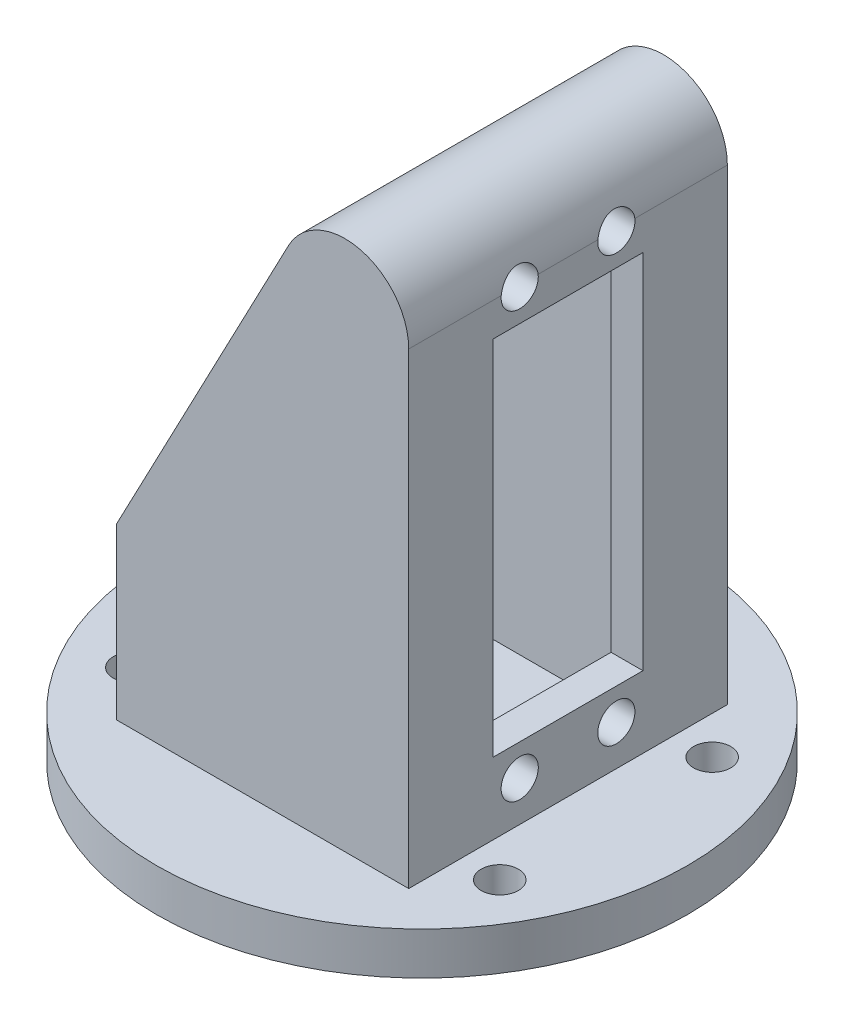
ISO-10303-21;
HEADER;
FILE_DESCRIPTION(('STEP AP214'),'2;1');
FILE_NAME('part.step','',(''),(''),'','','');
FILE_SCHEMA(('AUTOMOTIVE_DESIGN { 1 0 10303 214 1 1 1 1 }'));
ENDSEC;
DATA;
#1=APPLICATION_CONTEXT('core data for automotive mechanical design processes');
#2=APPLICATION_PROTOCOL_DEFINITION('international standard','automotive_design',2000,#1);
#3=PRODUCT_CONTEXT('',#1,'mechanical');
#4=PRODUCT('Part','Part','',(#3));
#5=PRODUCT_RELATED_PRODUCT_CATEGORY('part','',(#4));
#6=PRODUCT_DEFINITION_FORMATION('','',#4);
#7=PRODUCT_DEFINITION_CONTEXT('part definition',#1,'design');
#8=PRODUCT_DEFINITION('design','',#6,#7);
#9=PRODUCT_DEFINITION_SHAPE('','',#8);
#10=(LENGTH_UNIT() NAMED_UNIT(*) SI_UNIT(.MILLI.,.METRE.));
#11=(NAMED_UNIT(*) PLANE_ANGLE_UNIT() SI_UNIT($,.RADIAN.));
#12=(NAMED_UNIT(*) SI_UNIT($,.STERADIAN.) SOLID_ANGLE_UNIT());
#13=UNCERTAINTY_MEASURE_WITH_UNIT(LENGTH_MEASURE(1.E-05),#10,'distance_accuracy_value','');
#14=(GEOMETRIC_REPRESENTATION_CONTEXT(3) GLOBAL_UNCERTAINTY_ASSIGNED_CONTEXT((#13)) GLOBAL_UNIT_ASSIGNED_CONTEXT((#10,
#11,#12)) REPRESENTATION_CONTEXT('',''));
#15=CARTESIAN_POINT('',(0.,0.,0.));
#16=DIRECTION('',(0.,0.,1.));
#17=DIRECTION('',(1.,0.,0.));
#18=AXIS2_PLACEMENT_3D('',#15,#16,#17);
#19=CARTESIAN_POINT('',(10.75,0.,0.));
#20=DIRECTION('',(1.,0.,0.));
#21=DIRECTION('',(0.,0.,-1.));
#22=AXIS2_PLACEMENT_3D('',#19,#20,#21);
#23=PLANE('',#22);
#24=DIRECTION('',(0.,-1.,0.));
#25=VECTOR('',#24,1.);
#26=CARTESIAN_POINT('',(10.75,4.79216492436842,-8.5));
#27=LINE('',#26,#25);
#28=CARTESIAN_POINT('',(10.75,50.7921649243684,-8.5));
#29=VERTEX_POINT('',#28);
#30=CARTESIAN_POINT('',(10.75,4.79216492436842,-8.5));
#31=VERTEX_POINT('',#30);
#32=EDGE_CURVE('E643',#29,#31,#27,.T.);
#33=ORIENTED_EDGE('',*,*,#32,.T.);
#34=DIRECTION('',(0.,0.,1.));
#35=VECTOR('',#34,1.);
#36=CARTESIAN_POINT('',(10.75,4.79216492436842,-8.5));
#37=LINE('',#36,#35);
#38=CARTESIAN_POINT('',(10.75,4.79216492436842,8.5));
#39=VERTEX_POINT('',#38);
#40=EDGE_CURVE('E645',#31,#39,#37,.T.);
#41=ORIENTED_EDGE('',*,*,#40,.T.);
#42=DIRECTION('',(0.,1.,0.));
#43=VECTOR('',#42,1.);
#44=CARTESIAN_POINT('',(10.75,4.79216492436842,8.5));
#45=LINE('',#44,#43);
#46=CARTESIAN_POINT('',(10.75,50.7921649243684,8.5));
#47=VERTEX_POINT('',#46);
#48=EDGE_CURVE('E649',#39,#47,#45,.T.);
#49=ORIENTED_EDGE('',*,*,#48,.T.);
#50=DIRECTION('',(0.,0.,-1.));
#51=VECTOR('',#50,1.);
#52=CARTESIAN_POINT('',(10.75,50.7921649243684,-8.5));
#53=LINE('',#52,#51);
#54=EDGE_CURVE('E652',#47,#29,#53,.T.);
#55=ORIENTED_EDGE('',*,*,#54,.T.);
#56=EDGE_LOOP('',(#33,#41,#49,#55));
#57=FACE_BOUND('',#56,.T.);
#58=CARTESIAN_POINT('',(10.75,47.8021649243684,-4.55));
#59=DIRECTION('',(-1.,0.,0.));
#60=DIRECTION('',(0.,0.,1.));
#61=AXIS2_PLACEMENT_3D('',#58,#59,#60);
#62=CIRCLE('',#61,1.75);
#63=CARTESIAN_POINT('',(10.75,47.8021649243684,-2.8));
#64=VERTEX_POINT('',#63);
#65=EDGE_CURVE('E352',#64,#64,#62,.T.);
#66=ORIENTED_EDGE('',*,*,#65,.F.);
#67=EDGE_LOOP('',(#66));
#68=FACE_BOUND('',#67,.T.);
#69=CARTESIAN_POINT('',(10.75,7.78216492436842,-4.55));
#70=DIRECTION('',(-1.,0.,0.));
#71=DIRECTION('',(0.,0.,-1.));
#72=AXIS2_PLACEMENT_3D('',#69,#70,#71);
#73=CIRCLE('',#72,1.75);
#74=CARTESIAN_POINT('',(10.75,7.78216492436842,-6.3));
#75=VERTEX_POINT('',#74);
#76=EDGE_CURVE('E443',#75,#75,#73,.T.);
#77=ORIENTED_EDGE('',*,*,#76,.F.);
#78=EDGE_LOOP('',(#77));
#79=FACE_BOUND('',#78,.T.);
#80=CARTESIAN_POINT('',(10.75,7.78216492436842,4.55000000000001));
#81=DIRECTION('',(-1.,0.,0.));
#82=DIRECTION('',(0.,0.,1.));
#83=AXIS2_PLACEMENT_3D('',#80,#81,#82);
#84=CIRCLE('',#83,1.75);
#85=CARTESIAN_POINT('',(10.75,7.78216492436842,6.30000000000001));
#86=VERTEX_POINT('',#85);
#87=EDGE_CURVE('E181',#86,#86,#84,.T.);
#88=ORIENTED_EDGE('',*,*,#87,.F.);
#89=EDGE_LOOP('',(#88));
#90=FACE_BOUND('',#89,.T.);
#91=CARTESIAN_POINT('',(10.75,47.8021649243684,4.55));
#92=DIRECTION('',(-1.,0.,0.));
#93=DIRECTION('',(0.,0.,-1.));
#94=AXIS2_PLACEMENT_3D('',#91,#92,#93);
#95=CIRCLE('',#94,1.75);
#96=CARTESIAN_POINT('',(10.75,47.8021649243684,2.8));
#97=VERTEX_POINT('',#96);
#98=EDGE_CURVE('E173',#97,#97,#95,.T.);
#99=ORIENTED_EDGE('',*,*,#98,.F.);
#100=EDGE_LOOP('',(#99));
#101=FACE_BOUND('',#100,.T.);
#102=DIRECTION('',(0.,-1.,0.));
#103=VECTOR('',#102,1.);
#104=CARTESIAN_POINT('',(10.75,10.7421649243684,-7.05));
#105=LINE('',#104,#103);
#106=CARTESIAN_POINT('',(10.75,44.8421649243684,-7.05));
#107=VERTEX_POINT('',#106);
#108=CARTESIAN_POINT('',(10.75,10.7421649243684,-7.05));
#109=VERTEX_POINT('',#108);
#110=EDGE_CURVE('E403',#107,#109,#105,.T.);
#111=ORIENTED_EDGE('',*,*,#110,.F.);
#112=DIRECTION('',(0.,0.,-1.));
#113=VECTOR('',#112,1.);
#114=CARTESIAN_POINT('',(10.75,44.8421649243684,7.05));
#115=LINE('',#114,#113);
#116=CARTESIAN_POINT('',(10.75,44.8421649243684,7.05));
#117=VERTEX_POINT('',#116);
#118=EDGE_CURVE('E411',#117,#107,#115,.T.);
#119=ORIENTED_EDGE('',*,*,#118,.F.);
#120=DIRECTION('',(0.,1.,0.));
#121=VECTOR('',#120,1.);
#122=CARTESIAN_POINT('',(10.75,10.7421649243684,7.05));
#123=LINE('',#122,#121);
#124=CARTESIAN_POINT('',(10.75,10.7421649243684,7.05));
#125=VERTEX_POINT('',#124);
#126=EDGE_CURVE('E409',#125,#117,#123,.T.);
#127=ORIENTED_EDGE('',*,*,#126,.F.);
#128=DIRECTION('',(0.,0.,1.));
#129=VECTOR('',#128,1.);
#130=CARTESIAN_POINT('',(10.75,10.7421649243684,7.05));
#131=LINE('',#130,#129);
#132=EDGE_CURVE('E406',#109,#125,#131,.T.);
#133=ORIENTED_EDGE('',*,*,#132,.F.);
#134=EDGE_LOOP('',(#111,#119,#127,#133));
#135=FACE_BOUND('',#134,.T.);
#136=ADVANCED_FACE('F57',(#57,#68,#79,#90,#101,#135),#23,.F.);
#137=CARTESIAN_POINT('',(-19.0103038057282,9.99484804125848,-25.));
#138=DIRECTION('',(0.885121068855159,-0.465360820728068,0.));
#139=DIRECTION('',(0.465360820728068,0.885121068855159,0.));
#140=AXIS2_PLACEMENT_3D('',#137,#138,#139);
#141=PLANE('',#140);
#142=DIRECTION('',(0.,0.,1.));
#143=VECTOR('',#142,1.);
#144=CARTESIAN_POINT('',(-13.75,20.,-25.));
#145=LINE('',#144,#143);
#146=CARTESIAN_POINT('',(-13.75,20.,-15.));
#147=VERTEX_POINT('',#146);
#148=CARTESIAN_POINT('',(-13.75,20.,-8.5));
#149=VERTEX_POINT('',#148);
#150=EDGE_CURVE('E205',#147,#149,#145,.T.);
#151=ORIENTED_EDGE('',*,*,#150,.T.);
#152=DIRECTION('',(0.465360820728068,0.885121068855159,0.));
#153=VECTOR('',#152,1.);
#154=CARTESIAN_POINT('',(-19.0103038057282,9.99484804125848,-8.5));
#155=LINE('',#154,#153);
#156=CARTESIAN_POINT('',(2.43927358686905,50.7921649243684,-8.5));
#157=VERTEX_POINT('',#156);
#158=EDGE_CURVE('E187',#149,#157,#155,.T.);
#159=ORIENTED_EDGE('',*,*,#158,.T.);
#160=DIRECTION('',(0.,0.,1.));
#161=VECTOR('',#160,1.);
#162=CARTESIAN_POINT('',(2.43927358686906,50.7921649243684,-25.));
#163=LINE('',#162,#161);
#164=CARTESIAN_POINT('',(2.43927358686906,50.7921649243684,-15.));
#165=VERTEX_POINT('',#164);
#166=EDGE_CURVE('E210',#165,#157,#163,.T.);
#167=ORIENTED_EDGE('',*,*,#166,.F.);
#168=DIRECTION('',(0.465360820728068,0.885121068855159,0.));
#169=VECTOR('',#168,1.);
#170=CARTESIAN_POINT('',(6.21004174995811,57.9642047658331,-15.));
#171=LINE('',#170,#169);
#172=EDGE_CURVE('E12',#147,#165,#171,.T.);
#173=ORIENTED_EDGE('',*,*,#172,.F.);
#174=EDGE_LOOP('',(#151,#159,#167,#173));
#175=FACE_BOUND('',#174,.T.);
#176=ADVANCED_FACE('F294',(#175),#141,.F.);
#177=CARTESIAN_POINT('',(13.75,54.,15.));
#178=DIRECTION('',(0.,0.,-1.));
#179=DIRECTION('',(-1.,0.,0.));
#180=AXIS2_PLACEMENT_3D('',#177,#178,#179);
#181=PLANE('',#180);
#182=DIRECTION('',(0.,-1.,0.));
#183=VECTOR('',#182,1.);
#184=CARTESIAN_POINT('',(13.75,54.,15.));
#185=LINE('',#184,#183);
#186=CARTESIAN_POINT('',(13.75,48.,15.));
#187=VERTEX_POINT('',#186);
#188=CARTESIAN_POINT('',(13.75,4.,15.));
#189=VERTEX_POINT('',#188);
#190=EDGE_CURVE('E231',#187,#189,#185,.T.);
#191=ORIENTED_EDGE('',*,*,#190,.F.);
#192=CARTESIAN_POINT('',(7.75,48.,15.));
#193=DIRECTION('',(0.,0.,1.));
#194=DIRECTION('',(1.,0.,0.));
#195=AXIS2_PLACEMENT_3D('',#192,#193,#194);
#196=CIRCLE('',#195,6.);
#197=CARTESIAN_POINT('',(2.43927358686906,50.7921649243684,15.));
#198=VERTEX_POINT('',#197);
#199=EDGE_CURVE('E185',#198,#187,#196,.F.);
#200=ORIENTED_EDGE('',*,*,#199,.F.);
#201=DIRECTION('',(0.465360820728068,0.885121068855159,0.));
#202=VECTOR('',#201,1.);
#203=CARTESIAN_POINT('',(-19.0103038057282,9.99484804125848,15.));
#204=LINE('',#203,#202);
#205=CARTESIAN_POINT('',(-13.75,20.,15.));
#206=VERTEX_POINT('',#205);
#207=EDGE_CURVE('E195',#206,#198,#204,.T.);
#208=ORIENTED_EDGE('',*,*,#207,.F.);
#209=DIRECTION('',(0.,-1.,0.));
#210=VECTOR('',#209,1.);
#211=CARTESIAN_POINT('',(-13.75,54.,15.));
#212=LINE('',#211,#210);
#213=CARTESIAN_POINT('',(-13.75,4.,15.));
#214=VERTEX_POINT('',#213);
#215=EDGE_CURVE('E233',#206,#214,#212,.T.);
#216=ORIENTED_EDGE('',*,*,#215,.T.);
#217=DIRECTION('',(1.,0.,0.));
#218=VECTOR('',#217,1.);
#219=CARTESIAN_POINT('',(13.75,4.,15.));
#220=LINE('',#219,#218);
#221=EDGE_CURVE('E218',#214,#189,#220,.T.);
#222=ORIENTED_EDGE('',*,*,#221,.T.);
#223=EDGE_LOOP('',(#191,#200,#208,#216,#222));
#224=FACE_BOUND('',#223,.T.);
#225=ADVANCED_FACE('F300',(#224),#181,.F.);
#226=CARTESIAN_POINT('',(13.75,54.,-15.));
#227=DIRECTION('',(0.,0.,1.));
#228=DIRECTION('',(1.,0.,0.));
#229=AXIS2_PLACEMENT_3D('',#226,#227,#228);
#230=PLANE('',#229);
#231=CARTESIAN_POINT('',(7.75,48.,-15.));
#232=DIRECTION('',(0.,0.,1.));
#233=DIRECTION('',(1.,0.,0.));
#234=AXIS2_PLACEMENT_3D('',#231,#232,#233);
#235=CIRCLE('',#234,6.);
#236=CARTESIAN_POINT('',(13.75,48.,-15.));
#237=VERTEX_POINT('',#236);
#238=EDGE_CURVE('E208',#165,#237,#235,.F.);
#239=ORIENTED_EDGE('',*,*,#238,.T.);
#240=DIRECTION('',(0.,-1.,0.));
#241=VECTOR('',#240,1.);
#242=CARTESIAN_POINT('',(13.75,54.,-15.));
#243=LINE('',#242,#241);
#244=CARTESIAN_POINT('',(13.75,4.,-15.));
#245=VERTEX_POINT('',#244);
#246=EDGE_CURVE('E229',#237,#245,#243,.T.);
#247=ORIENTED_EDGE('',*,*,#246,.T.);
#248=DIRECTION('',(-1.,0.,0.));
#249=VECTOR('',#248,1.);
#250=CARTESIAN_POINT('',(13.75,4.,-15.));
#251=LINE('',#250,#249);
#252=CARTESIAN_POINT('',(-13.75,4.,-15.));
#253=VERTEX_POINT('',#252);
#254=EDGE_CURVE('E224',#245,#253,#251,.T.);
#255=ORIENTED_EDGE('',*,*,#254,.T.);
#256=DIRECTION('',(0.,-1.,0.));
#257=VECTOR('',#256,1.);
#258=CARTESIAN_POINT('',(-13.75,54.,-15.));
#259=LINE('',#258,#257);
#260=EDGE_CURVE('E227',#147,#253,#259,.T.);
#261=ORIENTED_EDGE('',*,*,#260,.F.);
#262=ORIENTED_EDGE('',*,*,#172,.T.);
#263=EDGE_LOOP('',(#239,#247,#255,#261,#262));
#264=FACE_BOUND('',#263,.T.);
#265=ADVANCED_FACE('F329',(#264),#230,.F.);
#266=CARTESIAN_POINT('',(13.75,54.,15.));
#267=DIRECTION('',(-1.,0.,0.));
#268=DIRECTION('',(0.,0.,1.));
#269=AXIS2_PLACEMENT_3D('',#266,#267,#268);
#270=PLANE('',#269);
#271=DIRECTION('',(0.,0.,1.));
#272=VECTOR('',#271,1.);
#273=CARTESIAN_POINT('',(13.75,44.8421649243684,7.05));
#274=LINE('',#273,#272);
#275=CARTESIAN_POINT('',(13.75,44.8421649243684,-7.05));
#276=VERTEX_POINT('',#275);
#277=CARTESIAN_POINT('',(13.75,44.8421649243684,7.05));
#278=VERTEX_POINT('',#277);
#279=EDGE_CURVE('E397',#276,#278,#274,.T.);
#280=ORIENTED_EDGE('',*,*,#279,.F.);
#281=DIRECTION('',(0.,1.,0.));
#282=VECTOR('',#281,1.);
#283=CARTESIAN_POINT('',(13.75,10.7421649243684,-7.05));
#284=LINE('',#283,#282);
#285=CARTESIAN_POINT('',(13.75,10.7421649243684,-7.05));
#286=VERTEX_POINT('',#285);
#287=EDGE_CURVE('E400',#286,#276,#284,.T.);
#288=ORIENTED_EDGE('',*,*,#287,.F.);
#289=DIRECTION('',(0.,0.,-1.));
#290=VECTOR('',#289,1.);
#291=CARTESIAN_POINT('',(13.75,10.7421649243684,7.05));
#292=LINE('',#291,#290);
#293=CARTESIAN_POINT('',(13.75,10.7421649243684,7.05));
#294=VERTEX_POINT('',#293);
#295=EDGE_CURVE('E417',#294,#286,#292,.T.);
#296=ORIENTED_EDGE('',*,*,#295,.F.);
#297=DIRECTION('',(0.,-1.,0.));
#298=VECTOR('',#297,1.);
#299=CARTESIAN_POINT('',(13.75,10.7421649243684,7.05));
#300=LINE('',#299,#298);
#301=EDGE_CURVE('E72',#278,#294,#300,.T.);
#302=ORIENTED_EDGE('',*,*,#301,.F.);
#303=EDGE_LOOP('',(#280,#288,#296,#302));
#304=FACE_BOUND('',#303,.T.);
#305=CARTESIAN_POINT('',(13.75,7.78216492436842,4.55000000000001));
#306=DIRECTION('',(-1.,0.,0.));
#307=DIRECTION('',(0.,0.,1.));
#308=AXIS2_PLACEMENT_3D('',#305,#306,#307);
#309=CIRCLE('',#308,1.75);
#310=CARTESIAN_POINT('',(13.75,7.78216492436842,6.30000000000001));
#311=VERTEX_POINT('',#310);
#312=EDGE_CURVE('E439',#311,#311,#309,.F.);
#313=ORIENTED_EDGE('',*,*,#312,.F.);
#314=EDGE_LOOP('',(#313));
#315=FACE_BOUND('',#314,.T.);
#316=CARTESIAN_POINT('',(13.75,7.78216492436842,-4.55));
#317=DIRECTION('',(-1.,0.,0.));
#318=DIRECTION('',(0.,0.,1.));
#319=AXIS2_PLACEMENT_3D('',#316,#317,#318);
#320=CIRCLE('',#319,1.75);
#321=CARTESIAN_POINT('',(13.75,7.78216492436842,-2.79999999999999));
#322=VERTEX_POINT('',#321);
#323=EDGE_CURVE('E357',#322,#322,#320,.F.);
#324=ORIENTED_EDGE('',*,*,#323,.F.);
#325=EDGE_LOOP('',(#324));
#326=FACE_BOUND('',#325,.T.);
#327=DIRECTION('',(0.,0.,1.));
#328=VECTOR('',#327,1.);
#329=CARTESIAN_POINT('',(13.75,48.,-25.));
#330=LINE('',#329,#328);
#331=CARTESIAN_POINT('',(13.75,48.,-2.81121844878379));
#332=VERTEX_POINT('',#331);
#333=CARTESIAN_POINT('',(13.75,48.,2.8112184487838));
#334=VERTEX_POINT('',#333);
#335=EDGE_CURVE('E180',#332,#334,#330,.T.);
#336=ORIENTED_EDGE('',*,*,#335,.T.);
#337=CARTESIAN_POINT('',(13.75,47.8021649243684,4.55));
#338=DIRECTION('',(-1.,0.,0.));
#339=DIRECTION('',(0.,0.,1.));
#340=AXIS2_PLACEMENT_3D('',#337,#338,#339);
#341=CIRCLE('',#340,1.75);
#342=CARTESIAN_POINT('',(13.75,48.,6.28878155121622));
#343=VERTEX_POINT('',#342);
#344=EDGE_CURVE('E79',#343,#334,#341,.F.);
#345=ORIENTED_EDGE('',*,*,#344,.F.);
#346=EDGE_CURVE('E177',#343,#187,#330,.T.);
#347=ORIENTED_EDGE('',*,*,#346,.T.);
#348=ORIENTED_EDGE('',*,*,#190,.T.);
#349=DIRECTION('',(0.,0.,-1.));
#350=VECTOR('',#349,1.);
#351=CARTESIAN_POINT('',(13.75,4.,15.));
#352=LINE('',#351,#350);
#353=EDGE_CURVE('E221',#189,#245,#352,.T.);
#354=ORIENTED_EDGE('',*,*,#353,.T.);
#355=ORIENTED_EDGE('',*,*,#246,.F.);
#356=CARTESIAN_POINT('',(13.75,48.,-6.28878155121621));
#357=VERTEX_POINT('',#356);
#358=EDGE_CURVE('E189',#237,#357,#330,.T.);
#359=ORIENTED_EDGE('',*,*,#358,.T.);
#360=CARTESIAN_POINT('',(13.75,47.8021649243684,-4.55));
#361=DIRECTION('',(-1.,0.,0.));
#362=DIRECTION('',(0.,0.,1.));
#363=AXIS2_PLACEMENT_3D('',#360,#361,#362);
#364=CIRCLE('',#363,1.75);
#365=EDGE_CURVE('E351',#332,#357,#364,.F.);
#366=ORIENTED_EDGE('',*,*,#365,.F.);
#367=EDGE_LOOP('',(#336,#345,#347,#348,#354,#355,#359,#366));
#368=FACE_BOUND('',#367,.T.);
#369=ADVANCED_FACE('F176',(#304,#315,#326,#368),#270,.F.);
#370=CARTESIAN_POINT('',(0.,4.,0.));
#371=DIRECTION('',(0.,1.,0.));
#372=DIRECTION('',(0.,0.,1.));
#373=AXIS2_PLACEMENT_3D('',#370,#371,#372);
#374=PLANE('',#373);
#375=DIRECTION('',(0.,0.,1.));
#376=VECTOR('',#375,1.);
#377=CARTESIAN_POINT('',(-13.75,4.,15.));
#378=LINE('',#377,#376);
#379=EDGE_CURVE('E215',#253,#214,#378,.T.);
#380=ORIENTED_EDGE('',*,*,#379,.F.);
#381=ORIENTED_EDGE('',*,*,#254,.F.);
#382=ORIENTED_EDGE('',*,*,#353,.F.);
#383=ORIENTED_EDGE('',*,*,#221,.F.);
#384=EDGE_LOOP('',(#380,#381,#382,#383));
#385=FACE_BOUND('',#384,.T.);
#386=CARTESIAN_POINT('',(17.3205080756888,4.,9.99999999999996));
#387=DIRECTION('',(0.,1.,0.));
#388=DIRECTION('',(0.,0.,1.));
#389=AXIS2_PLACEMENT_3D('',#386,#387,#388);
#390=CIRCLE('',#389,1.75);
#391=CARTESIAN_POINT('',(17.3205080756888,4.,11.75));
#392=VERTEX_POINT('',#391);
#393=EDGE_CURVE('E242',#392,#392,#390,.T.);
#394=ORIENTED_EDGE('',*,*,#393,.F.);
#395=EDGE_LOOP('',(#394));
#396=FACE_BOUND('',#395,.T.);
#397=CARTESIAN_POINT('',(-17.3205080756888,4.,-9.99999999999995));
#398=DIRECTION('',(0.,1.,0.));
#399=DIRECTION('',(0.,0.,1.));
#400=AXIS2_PLACEMENT_3D('',#397,#398,#399);
#401=CIRCLE('',#400,1.75);
#402=CARTESIAN_POINT('',(-17.3205080756888,4.,-8.24999999999994));
#403=VERTEX_POINT('',#402);
#404=EDGE_CURVE('E254',#403,#403,#401,.T.);
#405=ORIENTED_EDGE('',*,*,#404,.F.);
#406=EDGE_LOOP('',(#405));
#407=FACE_BOUND('',#406,.T.);
#408=CARTESIAN_POINT('',(0.,4.,0.));
#409=DIRECTION('',(0.,1.,0.));
#410=DIRECTION('',(0.,0.,1.));
#411=AXIS2_PLACEMENT_3D('',#408,#409,#410);
#412=CIRCLE('',#411,25.);
#413=CARTESIAN_POINT('',(0.,4.,25.));
#414=VERTEX_POINT('',#413);
#415=EDGE_CURVE('E65',#414,#414,#412,.T.);
#416=ORIENTED_EDGE('',*,*,#415,.T.);
#417=EDGE_LOOP('',(#416));
#418=FACE_BOUND('',#417,.T.);
#419=CARTESIAN_POINT('',(17.3205080756888,4.,-9.99999999999996));
#420=DIRECTION('',(0.,1.,0.));
#421=DIRECTION('',(0.,0.,-1.));
#422=AXIS2_PLACEMENT_3D('',#419,#420,#421);
#423=CIRCLE('',#422,1.75);
#424=CARTESIAN_POINT('',(17.3205080756888,4.,-11.75));
#425=VERTEX_POINT('',#424);
#426=EDGE_CURVE('E248',#425,#425,#423,.T.);
#427=ORIENTED_EDGE('',*,*,#426,.F.);
#428=EDGE_LOOP('',(#427));
#429=FACE_BOUND('',#428,.T.);
#430=CARTESIAN_POINT('',(-17.3205080756888,4.,9.99999999999996));
#431=DIRECTION('',(0.,1.,0.));
#432=DIRECTION('',(0.,0.,-1.));
#433=AXIS2_PLACEMENT_3D('',#430,#431,#432);
#434=CIRCLE('',#433,1.75);
#435=CARTESIAN_POINT('',(-17.3205080756888,4.,8.24999999999996));
#436=VERTEX_POINT('',#435);
#437=EDGE_CURVE('E236',#436,#436,#434,.T.);
#438=ORIENTED_EDGE('',*,*,#437,.F.);
#439=EDGE_LOOP('',(#438));
#440=FACE_BOUND('',#439,.T.);
#441=ADVANCED_FACE('F268',(#385,#396,#407,#418,#429,#440),#374,.T.);
#442=CARTESIAN_POINT('',(0.,0.,0.));
#443=DIRECTION('',(0.,1.,0.));
#444=DIRECTION('',(0.,0.,1.));
#445=AXIS2_PLACEMENT_3D('',#442,#443,#444);
#446=PLANE('',#445);
#447=CARTESIAN_POINT('',(0.,0.,0.));
#448=DIRECTION('',(0.,1.,0.));
#449=DIRECTION('',(0.,0.,1.));
#450=AXIS2_PLACEMENT_3D('',#447,#448,#449);
#451=CIRCLE('',#450,25.);
#452=CARTESIAN_POINT('',(0.,0.,25.));
#453=VERTEX_POINT('',#452);
#454=EDGE_CURVE('E257',#453,#453,#451,.T.);
#455=ORIENTED_EDGE('',*,*,#454,.F.);
#456=EDGE_LOOP('',(#455));
#457=FACE_BOUND('',#456,.T.);
#458=CARTESIAN_POINT('',(-17.3205080756888,0.,-9.99999999999995));
#459=DIRECTION('',(0.,1.,0.));
#460=DIRECTION('',(0.,0.,1.));
#461=AXIS2_PLACEMENT_3D('',#458,#459,#460);
#462=CIRCLE('',#461,1.75);
#463=CARTESIAN_POINT('',(-17.3205080756888,0.,-8.24999999999994));
#464=VERTEX_POINT('',#463);
#465=EDGE_CURVE('E251',#464,#464,#462,.T.);
#466=ORIENTED_EDGE('',*,*,#465,.T.);
#467=EDGE_LOOP('',(#466));
#468=FACE_BOUND('',#467,.T.);
#469=CARTESIAN_POINT('',(17.3205080756888,0.,-9.99999999999996));
#470=DIRECTION('',(0.,1.,0.));
#471=DIRECTION('',(0.,0.,-1.));
#472=AXIS2_PLACEMENT_3D('',#469,#470,#471);
#473=CIRCLE('',#472,1.75);
#474=CARTESIAN_POINT('',(17.3205080756888,0.,-11.75));
#475=VERTEX_POINT('',#474);
#476=EDGE_CURVE('E245',#475,#475,#473,.T.);
#477=ORIENTED_EDGE('',*,*,#476,.T.);
#478=EDGE_LOOP('',(#477));
#479=FACE_BOUND('',#478,.T.);
#480=CARTESIAN_POINT('',(17.3205080756888,0.,9.99999999999996));
#481=DIRECTION('',(0.,1.,0.));
#482=DIRECTION('',(0.,0.,1.));
#483=AXIS2_PLACEMENT_3D('',#480,#481,#482);
#484=CIRCLE('',#483,1.75);
#485=CARTESIAN_POINT('',(17.3205080756888,0.,11.75));
#486=VERTEX_POINT('',#485);
#487=EDGE_CURVE('E239',#486,#486,#484,.T.);
#488=ORIENTED_EDGE('',*,*,#487,.T.);
#489=EDGE_LOOP('',(#488));
#490=FACE_BOUND('',#489,.T.);
#491=CARTESIAN_POINT('',(-17.3205080756888,0.,9.99999999999996));
#492=DIRECTION('',(0.,1.,0.));
#493=DIRECTION('',(0.,0.,-1.));
#494=AXIS2_PLACEMENT_3D('',#491,#492,#493);
#495=CIRCLE('',#494,1.75);
#496=CARTESIAN_POINT('',(-17.3205080756888,0.,8.24999999999996));
#497=VERTEX_POINT('',#496);
#498=EDGE_CURVE('E235',#497,#497,#495,.T.);
#499=ORIENTED_EDGE('',*,*,#498,.T.);
#500=EDGE_LOOP('',(#499));
#501=FACE_BOUND('',#500,.T.);
#502=ADVANCED_FACE('F265',(#457,#468,#479,#490,#501),#446,.F.);
#503=CARTESIAN_POINT('',(0.,4.,0.));
#504=DIRECTION('',(0.,-1.,0.));
#505=DIRECTION('',(0.,0.,-1.));
#506=AXIS2_PLACEMENT_3D('',#503,#504,#505);
#507=CYLINDRICAL_SURFACE('',#506,25.);
#508=ORIENTED_EDGE('',*,*,#415,.F.);
#509=EDGE_LOOP('',(#508));
#510=FACE_BOUND('',#509,.T.);
#511=ORIENTED_EDGE('',*,*,#454,.T.);
#512=EDGE_LOOP('',(#511));
#513=FACE_BOUND('',#512,.T.);
#514=ADVANCED_FACE('F59',(#510,#513),#507,.T.);
#515=CARTESIAN_POINT('',(-17.3205080756888,4.,-9.99999999999995));
#516=DIRECTION('',(0.,-1.,0.));
#517=DIRECTION('',(0.,0.,-1.));
#518=AXIS2_PLACEMENT_3D('',#515,#516,#517);
#519=CYLINDRICAL_SURFACE('',#518,1.75);
#520=ORIENTED_EDGE('',*,*,#404,.T.);
#521=EDGE_LOOP('',(#520));
#522=FACE_BOUND('',#521,.T.);
#523=ORIENTED_EDGE('',*,*,#465,.F.);
#524=EDGE_LOOP('',(#523));
#525=FACE_BOUND('',#524,.T.);
#526=ADVANCED_FACE('F543',(#522,#525),#519,.F.);
#527=CARTESIAN_POINT('',(17.3205080756888,4.,-9.99999999999996));
#528=DIRECTION('',(0.,-1.,0.));
#529=DIRECTION('',(0.,0.,-1.));
#530=AXIS2_PLACEMENT_3D('',#527,#528,#529);
#531=CYLINDRICAL_SURFACE('',#530,1.75);
#532=ORIENTED_EDGE('',*,*,#426,.T.);
#533=EDGE_LOOP('',(#532));
#534=FACE_BOUND('',#533,.T.);
#535=ORIENTED_EDGE('',*,*,#476,.F.);
#536=EDGE_LOOP('',(#535));
#537=FACE_BOUND('',#536,.T.);
#538=ADVANCED_FACE('F290',(#534,#537),#531,.F.);
#539=CARTESIAN_POINT('',(17.3205080756888,4.,9.99999999999996));
#540=DIRECTION('',(0.,-1.,0.));
#541=DIRECTION('',(0.,0.,-1.));
#542=AXIS2_PLACEMENT_3D('',#539,#540,#541);
#543=CYLINDRICAL_SURFACE('',#542,1.75);
#544=ORIENTED_EDGE('',*,*,#393,.T.);
#545=EDGE_LOOP('',(#544));
#546=FACE_BOUND('',#545,.T.);
#547=ORIENTED_EDGE('',*,*,#487,.F.);
#548=EDGE_LOOP('',(#547));
#549=FACE_BOUND('',#548,.T.);
#550=ADVANCED_FACE('F280',(#546,#549),#543,.F.);
#551=CARTESIAN_POINT('',(-17.3205080756888,4.,9.99999999999996));
#552=DIRECTION('',(0.,-1.,0.));
#553=DIRECTION('',(0.,0.,-1.));
#554=AXIS2_PLACEMENT_3D('',#551,#552,#553);
#555=CYLINDRICAL_SURFACE('',#554,1.75);
#556=ORIENTED_EDGE('',*,*,#437,.T.);
#557=EDGE_LOOP('',(#556));
#558=FACE_BOUND('',#557,.T.);
#559=ORIENTED_EDGE('',*,*,#498,.F.);
#560=EDGE_LOOP('',(#559));
#561=FACE_BOUND('',#560,.T.);
#562=ADVANCED_FACE('F277',(#558,#561),#555,.F.);
#563=CARTESIAN_POINT('',(-13.75,54.,15.));
#564=DIRECTION('',(1.,0.,0.));
#565=DIRECTION('',(0.,0.,-1.));
#566=AXIS2_PLACEMENT_3D('',#563,#564,#565);
#567=PLANE('',#566);
#568=DIRECTION('',(0.,0.,1.));
#569=VECTOR('',#568,1.);
#570=CARTESIAN_POINT('',(-13.75,4.79216492436842,-8.5));
#571=LINE('',#570,#569);
#572=CARTESIAN_POINT('',(-13.75,4.79216492436842,-8.5));
#573=VERTEX_POINT('',#572);
#574=CARTESIAN_POINT('',(-13.75,4.79216492436842,8.5));
#575=VERTEX_POINT('',#574);
#576=EDGE_CURVE('E657',#573,#575,#571,.T.);
#577=ORIENTED_EDGE('',*,*,#576,.F.);
#578=DIRECTION('',(0.,-1.,0.));
#579=VECTOR('',#578,1.);
#580=CARTESIAN_POINT('',(-13.75,4.79216492436842,-8.5));
#581=LINE('',#580,#579);
#582=EDGE_CURVE('E354',#149,#573,#581,.T.);
#583=ORIENTED_EDGE('',*,*,#582,.F.);
#584=ORIENTED_EDGE('',*,*,#150,.F.);
#585=ORIENTED_EDGE('',*,*,#260,.T.);
#586=ORIENTED_EDGE('',*,*,#379,.T.);
#587=ORIENTED_EDGE('',*,*,#215,.F.);
#588=CARTESIAN_POINT('',(-13.75,20.,8.5));
#589=VERTEX_POINT('',#588);
#590=EDGE_CURVE('E209',#589,#206,#145,.T.);
#591=ORIENTED_EDGE('',*,*,#590,.F.);
#592=DIRECTION('',(0.,1.,0.));
#593=VECTOR('',#592,1.);
#594=CARTESIAN_POINT('',(-13.75,4.79216492436842,8.5));
#595=LINE('',#594,#593);
#596=EDGE_CURVE('E646',#575,#589,#595,.T.);
#597=ORIENTED_EDGE('',*,*,#596,.F.);
#598=EDGE_LOOP('',(#577,#583,#584,#585,#586,#587,#591,#597));
#599=FACE_BOUND('',#598,.T.);
#600=ADVANCED_FACE('F279',(#599),#567,.F.);
#601=CARTESIAN_POINT('',(2.43927358686906,50.7921649243684,8.5));
#602=VERTEX_POINT('',#601);
#603=EDGE_CURVE('E202',#602,#198,#163,.T.);
#604=ORIENTED_EDGE('',*,*,#603,.F.);
#605=DIRECTION('',(-0.465360820728068,-0.885121068855159,0.));
#606=VECTOR('',#605,1.);
#607=CARTESIAN_POINT('',(-19.0103038057282,9.99484804125848,8.5));
#608=LINE('',#607,#606);
#609=EDGE_CURVE('E191',#602,#589,#608,.T.);
#610=ORIENTED_EDGE('',*,*,#609,.T.);
#611=ORIENTED_EDGE('',*,*,#590,.T.);
#612=ORIENTED_EDGE('',*,*,#207,.T.);
#613=EDGE_LOOP('',(#604,#610,#611,#612));
#614=FACE_BOUND('',#613,.T.);
#615=ADVANCED_FACE('F287',(#614),#141,.F.);
#616=CARTESIAN_POINT('',(7.75,48.,-25.));
#617=DIRECTION('',(0.,0.,1.));
#618=DIRECTION('',(1.,0.,0.));
#619=AXIS2_PLACEMENT_3D('',#616,#617,#618);
#620=CYLINDRICAL_SURFACE('',#619,6.);
#621=ORIENTED_EDGE('',*,*,#346,.F.);
#622=CARTESIAN_POINT('',(13.75,48.,2.8112184487838));
#623=CARTESIAN_POINT('',(13.7500031113065,48.0480571657358,2.81668552688876));
#624=CARTESIAN_POINT('',(13.7494219949771,48.095862702885,2.8241448946866));
#625=CARTESIAN_POINT('',(13.7471569182976,48.1906584661458,2.84298240129894));
#626=CARTESIAN_POINT('',(13.7454731930517,48.2376488638736,2.85435970446552));
#627=CARTESIAN_POINT('',(13.7388794028582,48.3766793501752,2.89419418877104));
#628=CARTESIAN_POINT('',(13.7324259317994,48.4670728703313,2.92838784037697));
#629=CARTESIAN_POINT('',(13.7163323803745,48.6407063418044,3.01097298322699));
#630=CARTESIAN_POINT('',(13.7066931886239,48.7239482798136,3.05936051484984));
#631=CARTESIAN_POINT('',(13.6854595429873,48.8812630638497,3.16897215710086));
#632=CARTESIAN_POINT('',(13.6738643949725,48.9553326385535,3.23020082666934));
#633=CARTESIAN_POINT('',(13.6498466918076,49.0940231663913,3.36543237523951));
#634=CARTESIAN_POINT('',(13.6374111859494,49.1583852296192,3.43969851729436));
#635=CARTESIAN_POINT('',(13.6135103006602,49.2738656246803,3.5980544591167));
#636=CARTESIAN_POINT('',(13.6020450236915,49.3249825589176,3.68214529420634));
#637=CARTESIAN_POINT('',(13.5814411970689,49.4129272489291,3.85879169859229));
#638=CARTESIAN_POINT('',(13.572325863916,49.449614177333,3.95142030365246));
#639=CARTESIAN_POINT('',(13.5577924357784,49.5067938408749,4.14181659179955));
#640=CARTESIAN_POINT('',(13.5523733522587,49.527290906106,4.23958289330747));
#641=CARTESIAN_POINT('',(13.5460712084788,49.5510339352558,4.43454562756091));
#642=CARTESIAN_POINT('',(13.5450652964159,49.5547472092455,4.5316812615177));
#643=CARTESIAN_POINT('',(13.5473872536685,49.5460662194098,4.72517082041726));
#644=CARTESIAN_POINT('',(13.5507147646418,49.5336732874491,4.82152480933337));
#645=CARTESIAN_POINT('',(13.5611696686113,49.49355982601,5.00904741843954));
#646=CARTESIAN_POINT('',(13.5682319837318,49.4661015082254,5.10027610703323));
#647=CARTESIAN_POINT('',(13.5852323771949,49.3968983871693,5.27685721726102));
#648=CARTESIAN_POINT('',(13.5951709219403,49.3551512666574,5.36220868307714));
#649=CARTESIAN_POINT('',(13.6169803885917,49.2574169355268,5.5267873705802));
#650=CARTESIAN_POINT('',(13.6288908774158,49.2011211130878,5.60582598646335));
#651=CARTESIAN_POINT('',(13.6530197832337,49.0762855661022,5.75352353480909));
#652=CARTESIAN_POINT('',(13.6652382624936,49.0077433483824,5.82218034843536));
#653=CARTESIAN_POINT('',(13.688780203072,48.8583351981861,5.94886784581556));
#654=CARTESIAN_POINT('',(13.7000743556652,48.7772081973528,6.00659654131205));
#655=CARTESIAN_POINT('',(13.7199261603179,48.606116683116,6.10756614424532));
#656=CARTESIAN_POINT('',(13.7284857616725,48.5161585249761,6.15081737284207));
#657=CARTESIAN_POINT('',(13.7398664088393,48.3551535074877,6.21192309476903));
#658=CARTESIAN_POINT('',(13.7436127028414,48.2855541199761,6.23348138635531));
#659=CARTESIAN_POINT('',(13.748690991845,48.1441574997206,6.26780438848019));
#660=CARTESIAN_POINT('',(13.7500236485641,48.0723608748575,6.28057150859247));
#661=CARTESIAN_POINT('',(13.75,48.,6.28878155121621));
#662=B_SPLINE_CURVE_WITH_KNOTS('',3,(#622,#623,#624,#625,#626,#627,#628,#629,#630,#631,#632,
#633,#634,#635,#636,#637,#638,#639,#640,#641,#642,#643,#644,#645,#646,#647,#648,#649,#650,#651,
#652,#653,#654,#655,#656,#657,#658,#659,#660,#661),.UNSPECIFIED.,.F.,.F.,(4,2,2,2,2,2,2,2,2,2,2,
2,2,2,2,2,2,2,2,4),(0.,0.145008005997473,0.289985102688877,0.579062708493356,0.868059747812008,
1.15715956286353,1.45296233536445,1.74879630760454,2.04744975230043,2.34602329295554,
2.63623030465922,2.92641331990284,3.21169895486026,3.49703087702882,3.78899900878847,
4.08102664853261,4.38021808210816,4.67919576196199,4.8974941063628,5.11573259349113),.UNSPECIFIED.);
#663=EDGE_CURVE('E167',#334,#343,#662,.T.);
#664=ORIENTED_EDGE('',*,*,#663,.F.);
#665=ORIENTED_EDGE('',*,*,#335,.F.);
#666=CARTESIAN_POINT('',(13.75,48.,-6.2887815512162));
#667=CARTESIAN_POINT('',(13.7500031113065,48.0480571657358,-6.28331447311124));
#668=CARTESIAN_POINT('',(13.7494219949771,48.095862702885,-6.2758551053134));
#669=CARTESIAN_POINT('',(13.7471569182976,48.1906584661458,-6.25701759870106));
#670=CARTESIAN_POINT('',(13.7454731930517,48.2376488638736,-6.24564029553448));
#671=CARTESIAN_POINT('',(13.7388794028582,48.3766793501752,-6.20580581122896));
#672=CARTESIAN_POINT('',(13.7324259317994,48.4670728703313,-6.17161215962304));
#673=CARTESIAN_POINT('',(13.7163323803745,48.6407063418044,-6.08902701677301));
#674=CARTESIAN_POINT('',(13.7066931886239,48.7239482798136,-6.04063948515017));
#675=CARTESIAN_POINT('',(13.6854595429873,48.8812630638497,-5.93102784289915));
#676=CARTESIAN_POINT('',(13.6738643949725,48.9553326385535,-5.86979917333067));
#677=CARTESIAN_POINT('',(13.6498466918076,49.0940231663913,-5.7345676247605));
#678=CARTESIAN_POINT('',(13.6374111859494,49.1583852296192,-5.66030148270564));
#679=CARTESIAN_POINT('',(13.6135103006602,49.2738656246803,-5.50194554088331));
#680=CARTESIAN_POINT('',(13.6020450236915,49.3249825589176,-5.41785470579367));
#681=CARTESIAN_POINT('',(13.5814411970689,49.4129272489291,-5.24120830140772));
#682=CARTESIAN_POINT('',(13.572325863916,49.449614177333,-5.14857969634755));
#683=CARTESIAN_POINT('',(13.5577924357784,49.5067938408749,-4.95818340820046));
#684=CARTESIAN_POINT('',(13.5523733522587,49.527290906106,-4.86041710669254));
#685=CARTESIAN_POINT('',(13.5460712084788,49.5510339352558,-4.6654543724391));
#686=CARTESIAN_POINT('',(13.5450652964159,49.5547472092455,-4.56831873848231));
#687=CARTESIAN_POINT('',(13.5473872536685,49.5460662194098,-4.37482917958274));
#688=CARTESIAN_POINT('',(13.5507147646418,49.5336732874491,-4.27847519066664));
#689=CARTESIAN_POINT('',(13.5611696686113,49.49355982601,-4.09095258156046));
#690=CARTESIAN_POINT('',(13.5682319837318,49.4661015082254,-3.99972389296678));
#691=CARTESIAN_POINT('',(13.5852323771949,49.3968983871693,-3.82314278273898));
#692=CARTESIAN_POINT('',(13.5951709219403,49.3551512666574,-3.73779131692286));
#693=CARTESIAN_POINT('',(13.6169803885917,49.2574169355268,-3.57321262941981));
#694=CARTESIAN_POINT('',(13.6288908774158,49.2011211130878,-3.49417401353666));
#695=CARTESIAN_POINT('',(13.6530197832337,49.0762855661022,-3.34647646519092));
#696=CARTESIAN_POINT('',(13.6652382624936,49.0077433483824,-3.27781965156464));
#697=CARTESIAN_POINT('',(13.688780203072,48.8583351981861,-3.15113215418444));
#698=CARTESIAN_POINT('',(13.7000743556652,48.7772081973528,-3.09340345868796));
#699=CARTESIAN_POINT('',(13.7199261603179,48.606116683116,-2.99243385575469));
#700=CARTESIAN_POINT('',(13.7284857616725,48.5161585249761,-2.94918262715794));
#701=CARTESIAN_POINT('',(13.7398664088393,48.3551535074877,-2.88807690523097));
#702=CARTESIAN_POINT('',(13.7436127028414,48.2855541199761,-2.86651861364469));
#703=CARTESIAN_POINT('',(13.748690991845,48.1441574997206,-2.83219561151981));
#704=CARTESIAN_POINT('',(13.7500236485641,48.0723608748575,-2.81942849140753));
#705=CARTESIAN_POINT('',(13.75,48.,-2.81121844878379));
#706=B_SPLINE_CURVE_WITH_KNOTS('',3,(#666,#667,#668,#669,#670,#671,#672,#673,#674,#675,#676,
#677,#678,#679,#680,#681,#682,#683,#684,#685,#686,#687,#688,#689,#690,#691,#692,#693,#694,#695,
#696,#697,#698,#699,#700,#701,#702,#703,#704,#705),.UNSPECIFIED.,.F.,.F.,(4,2,2,2,2,2,2,2,2,2,2,
2,2,2,2,2,2,2,2,4),(0.,0.145008005997473,0.28998510268887,0.579062708493348,0.868059747811998,
1.15715956286353,1.45296233536443,1.74879630760453,2.04744975230042,2.34602329295553,
2.63623030465921,2.92641331990283,3.21169895486026,3.49703087702881,3.78899900878846,
4.0810266485326,4.38021808210814,4.67919576196198,4.89749410636279,5.11573259349113),.UNSPECIFIED.);
#707=EDGE_CURVE('E349',#357,#332,#706,.T.);
#708=ORIENTED_EDGE('',*,*,#707,.F.);
#709=ORIENTED_EDGE('',*,*,#358,.F.);
#710=ORIENTED_EDGE('',*,*,#238,.F.);
#711=ORIENTED_EDGE('',*,*,#166,.T.);
#712=EDGE_CURVE('E213',#157,#602,#163,.T.);
#713=ORIENTED_EDGE('',*,*,#712,.T.);
#714=ORIENTED_EDGE('',*,*,#603,.T.);
#715=ORIENTED_EDGE('',*,*,#199,.T.);
#716=EDGE_LOOP('',(#621,#664,#665,#708,#709,#710,#711,#713,#714,#715));
#717=FACE_BOUND('',#716,.T.);
#718=ADVANCED_FACE('F183',(#717),#620,.T.);
#719=CARTESIAN_POINT('',(10.75,4.79216492436842,-8.5));
#720=DIRECTION('',(0.,0.,-1.));
#721=DIRECTION('',(-1.,0.,0.));
#722=AXIS2_PLACEMENT_3D('',#719,#720,#721);
#723=PLANE('',#722);
#724=ORIENTED_EDGE('',*,*,#582,.T.);
#725=DIRECTION('',(-1.,0.,0.));
#726=VECTOR('',#725,1.);
#727=CARTESIAN_POINT('',(10.75,4.79216492436842,-8.5));
#728=LINE('',#727,#726);
#729=EDGE_CURVE('E655',#31,#573,#728,.T.);
#730=ORIENTED_EDGE('',*,*,#729,.F.);
#731=ORIENTED_EDGE('',*,*,#32,.F.);
#732=DIRECTION('',(-1.,0.,0.));
#733=VECTOR('',#732,1.);
#734=CARTESIAN_POINT('',(10.75,50.7921649243684,-8.5));
#735=LINE('',#734,#733);
#736=EDGE_CURVE('E661',#29,#157,#735,.T.);
#737=ORIENTED_EDGE('',*,*,#736,.T.);
#738=ORIENTED_EDGE('',*,*,#158,.F.);
#739=EDGE_LOOP('',(#724,#730,#731,#737,#738));
#740=FACE_BOUND('',#739,.T.);
#741=ADVANCED_FACE('F314',(#740),#723,.F.);
#742=CARTESIAN_POINT('',(10.75,50.7921649243684,-8.5));
#743=DIRECTION('',(0.,1.,0.));
#744=DIRECTION('',(0.,0.,1.));
#745=AXIS2_PLACEMENT_3D('',#742,#743,#744);
#746=PLANE('',#745);
#747=ORIENTED_EDGE('',*,*,#736,.F.);
#748=ORIENTED_EDGE('',*,*,#54,.F.);
#749=DIRECTION('',(-1.,0.,0.));
#750=VECTOR('',#749,1.);
#751=CARTESIAN_POINT('',(10.75,50.7921649243684,8.5));
#752=LINE('',#751,#750);
#753=EDGE_CURVE('E664',#47,#602,#752,.T.);
#754=ORIENTED_EDGE('',*,*,#753,.T.);
#755=ORIENTED_EDGE('',*,*,#712,.F.);
#756=EDGE_LOOP('',(#747,#748,#754,#755));
#757=FACE_BOUND('',#756,.T.);
#758=ADVANCED_FACE('F310',(#757),#746,.F.);
#759=CARTESIAN_POINT('',(10.75,4.79216492436842,8.5));
#760=DIRECTION('',(0.,0.,1.));
#761=DIRECTION('',(1.,0.,0.));
#762=AXIS2_PLACEMENT_3D('',#759,#760,#761);
#763=PLANE('',#762);
#764=ORIENTED_EDGE('',*,*,#753,.F.);
#765=ORIENTED_EDGE('',*,*,#48,.F.);
#766=DIRECTION('',(-1.,0.,0.));
#767=VECTOR('',#766,1.);
#768=CARTESIAN_POINT('',(10.75,4.79216492436842,8.5));
#769=LINE('',#768,#767);
#770=EDGE_CURVE('E666',#39,#575,#769,.T.);
#771=ORIENTED_EDGE('',*,*,#770,.T.);
#772=ORIENTED_EDGE('',*,*,#596,.T.);
#773=ORIENTED_EDGE('',*,*,#609,.F.);
#774=EDGE_LOOP('',(#764,#765,#771,#772,#773));
#775=FACE_BOUND('',#774,.T.);
#776=ADVANCED_FACE('F313',(#775),#763,.F.);
#777=CARTESIAN_POINT('',(10.75,4.79216492436842,-8.5));
#778=DIRECTION('',(0.,-1.,0.));
#779=DIRECTION('',(0.,0.,-1.));
#780=AXIS2_PLACEMENT_3D('',#777,#778,#779);
#781=PLANE('',#780);
#782=ORIENTED_EDGE('',*,*,#576,.T.);
#783=ORIENTED_EDGE('',*,*,#770,.F.);
#784=ORIENTED_EDGE('',*,*,#40,.F.);
#785=ORIENTED_EDGE('',*,*,#729,.T.);
#786=EDGE_LOOP('',(#782,#783,#784,#785));
#787=FACE_BOUND('',#786,.T.);
#788=ADVANCED_FACE('F318',(#787),#781,.F.);
#789=CARTESIAN_POINT('',(25.001,47.8021649243684,-4.55));
#790=DIRECTION('',(-1.,0.,0.));
#791=DIRECTION('',(0.,0.,1.));
#792=AXIS2_PLACEMENT_3D('',#789,#790,#791);
#793=CYLINDRICAL_SURFACE('',#792,1.75);
#794=ORIENTED_EDGE('',*,*,#65,.T.);
#795=EDGE_LOOP('',(#794));
#796=FACE_BOUND('',#795,.T.);
#797=ORIENTED_EDGE('',*,*,#365,.T.);
#798=ORIENTED_EDGE('',*,*,#707,.T.);
#799=EDGE_LOOP('',(#797,#798));
#800=FACE_BOUND('',#799,.T.);
#801=ADVANCED_FACE('F307',(#796,#800),#793,.F.);
#802=CARTESIAN_POINT('',(25.001,7.78216492436842,-4.55));
#803=DIRECTION('',(-1.,0.,0.));
#804=DIRECTION('',(0.,0.,1.));
#805=AXIS2_PLACEMENT_3D('',#802,#803,#804);
#806=CYLINDRICAL_SURFACE('',#805,1.75);
#807=ORIENTED_EDGE('',*,*,#76,.T.);
#808=EDGE_LOOP('',(#807));
#809=FACE_BOUND('',#808,.T.);
#810=ORIENTED_EDGE('',*,*,#323,.T.);
#811=EDGE_LOOP('',(#810));
#812=FACE_BOUND('',#811,.T.);
#813=ADVANCED_FACE('F451',(#809,#812),#806,.F.);
#814=CARTESIAN_POINT('',(25.001,7.78216492436842,4.55000000000001));
#815=DIRECTION('',(-1.,0.,0.));
#816=DIRECTION('',(0.,0.,1.));
#817=AXIS2_PLACEMENT_3D('',#814,#815,#816);
#818=CYLINDRICAL_SURFACE('',#817,1.75);
#819=ORIENTED_EDGE('',*,*,#87,.T.);
#820=EDGE_LOOP('',(#819));
#821=FACE_BOUND('',#820,.T.);
#822=ORIENTED_EDGE('',*,*,#312,.T.);
#823=EDGE_LOOP('',(#822));
#824=FACE_BOUND('',#823,.T.);
#825=ADVANCED_FACE('F385',(#821,#824),#818,.F.);
#826=CARTESIAN_POINT('',(25.001,47.8021649243684,4.55));
#827=DIRECTION('',(-1.,0.,0.));
#828=DIRECTION('',(0.,0.,1.));
#829=AXIS2_PLACEMENT_3D('',#826,#827,#828);
#830=CYLINDRICAL_SURFACE('',#829,1.75);
#831=ORIENTED_EDGE('',*,*,#98,.T.);
#832=EDGE_LOOP('',(#831));
#833=FACE_BOUND('',#832,.T.);
#834=ORIENTED_EDGE('',*,*,#344,.T.);
#835=ORIENTED_EDGE('',*,*,#663,.T.);
#836=EDGE_LOOP('',(#834,#835));
#837=FACE_BOUND('',#836,.T.);
#838=ADVANCED_FACE('F168',(#833,#837),#830,.F.);
#839=CARTESIAN_POINT('',(25.001,10.7421649243684,-7.05));
#840=DIRECTION('',(0.,0.,-1.));
#841=DIRECTION('',(-1.,0.,0.));
#842=AXIS2_PLACEMENT_3D('',#839,#840,#841);
#843=PLANE('',#842);
#844=ORIENTED_EDGE('',*,*,#287,.T.);
#845=DIRECTION('',(-1.,0.,0.));
#846=VECTOR('',#845,1.);
#847=CARTESIAN_POINT('',(25.001,44.8421649243684,-7.05));
#848=LINE('',#847,#846);
#849=EDGE_CURVE('E415',#276,#107,#848,.T.);
#850=ORIENTED_EDGE('',*,*,#849,.T.);
#851=ORIENTED_EDGE('',*,*,#110,.T.);
#852=DIRECTION('',(-1.,0.,0.));
#853=VECTOR('',#852,1.);
#854=CARTESIAN_POINT('',(25.001,10.7421649243684,-7.05));
#855=LINE('',#854,#853);
#856=EDGE_CURVE('E414',#286,#109,#855,.T.);
#857=ORIENTED_EDGE('',*,*,#856,.F.);
#858=EDGE_LOOP('',(#844,#850,#851,#857));
#859=FACE_BOUND('',#858,.T.);
#860=ADVANCED_FACE('F367',(#859),#843,.F.);
#861=CARTESIAN_POINT('',(25.001,44.8421649243684,7.05));
#862=DIRECTION('',(0.,1.,0.));
#863=DIRECTION('',(0.,0.,1.));
#864=AXIS2_PLACEMENT_3D('',#861,#862,#863);
#865=PLANE('',#864);
#866=ORIENTED_EDGE('',*,*,#279,.T.);
#867=DIRECTION('',(-1.,0.,0.));
#868=VECTOR('',#867,1.);
#869=CARTESIAN_POINT('',(25.001,44.8421649243684,7.05));
#870=LINE('',#869,#868);
#871=EDGE_CURVE('E418',#278,#117,#870,.T.);
#872=ORIENTED_EDGE('',*,*,#871,.T.);
#873=ORIENTED_EDGE('',*,*,#118,.T.);
#874=ORIENTED_EDGE('',*,*,#849,.F.);
#875=EDGE_LOOP('',(#866,#872,#873,#874));
#876=FACE_BOUND('',#875,.T.);
#877=ADVANCED_FACE('F370',(#876),#865,.F.);
#878=CARTESIAN_POINT('',(25.001,10.7421649243684,7.05));
#879=DIRECTION('',(0.,0.,1.));
#880=DIRECTION('',(1.,0.,0.));
#881=AXIS2_PLACEMENT_3D('',#878,#879,#880);
#882=PLANE('',#881);
#883=ORIENTED_EDGE('',*,*,#301,.T.);
#884=DIRECTION('',(-1.,0.,0.));
#885=VECTOR('',#884,1.);
#886=CARTESIAN_POINT('',(25.001,10.7421649243684,7.05));
#887=LINE('',#886,#885);
#888=EDGE_CURVE('E421',#294,#125,#887,.T.);
#889=ORIENTED_EDGE('',*,*,#888,.T.);
#890=ORIENTED_EDGE('',*,*,#126,.T.);
#891=ORIENTED_EDGE('',*,*,#871,.F.);
#892=EDGE_LOOP('',(#883,#889,#890,#891));
#893=FACE_BOUND('',#892,.T.);
#894=ADVANCED_FACE('F375',(#893),#882,.F.);
#895=CARTESIAN_POINT('',(25.001,10.7421649243684,7.05));
#896=DIRECTION('',(0.,-1.,0.));
#897=DIRECTION('',(0.,0.,-1.));
#898=AXIS2_PLACEMENT_3D('',#895,#896,#897);
#899=PLANE('',#898);
#900=ORIENTED_EDGE('',*,*,#295,.T.);
#901=ORIENTED_EDGE('',*,*,#856,.T.);
#902=ORIENTED_EDGE('',*,*,#132,.T.);
#903=ORIENTED_EDGE('',*,*,#888,.F.);
#904=EDGE_LOOP('',(#900,#901,#902,#903));
#905=FACE_BOUND('',#904,.T.);
#906=ADVANCED_FACE('F372',(#905),#899,.F.);
#907=CLOSED_SHELL('',(#136,#176,#225,#265,#369,#441,#502,#514,#526,#538,#550,#562,#600,#615,
#718,#741,#758,#776,#788,#801,#813,#825,#838,#860,#877,#894,#906));
#908=MANIFOLD_SOLID_BREP('B2',#907);
#909=ADVANCED_BREP_SHAPE_REPRESENTATION('',(#18,#908),#14);
#910=SHAPE_DEFINITION_REPRESENTATION(#9,#909);
ENDSEC;
END-ISO-10303-21;
